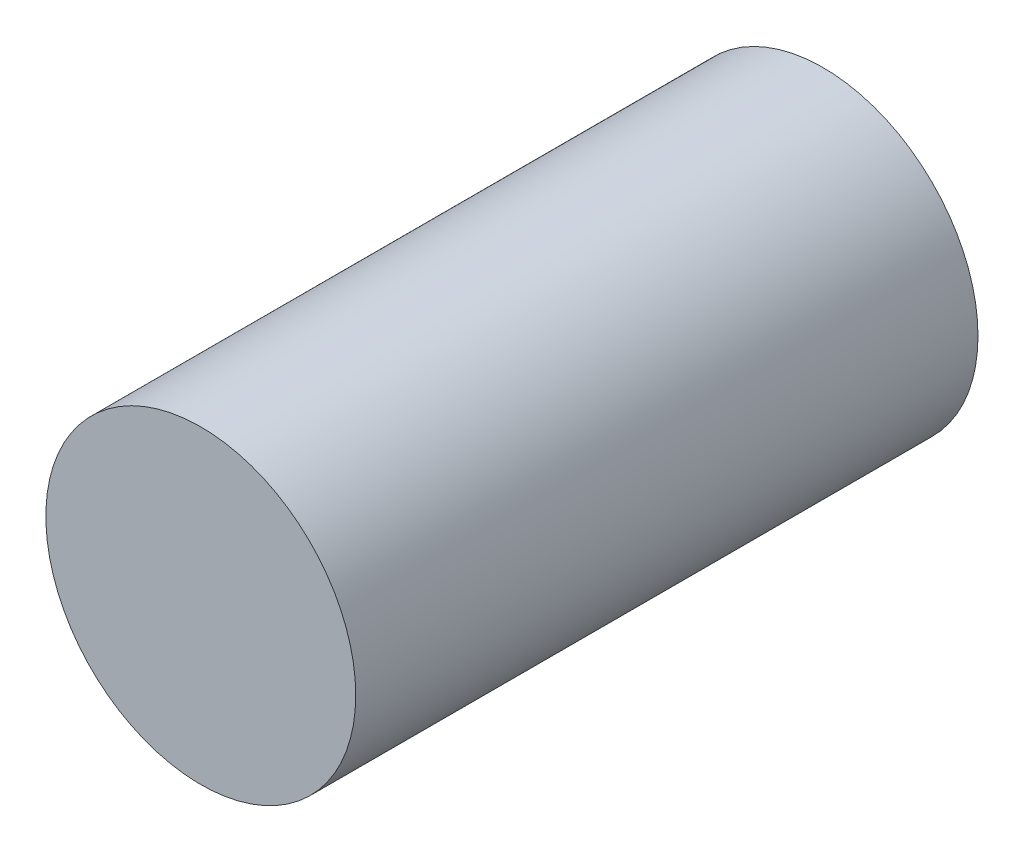
ISO-10303-21;
HEADER;
FILE_DESCRIPTION(('STEP AP214'),'2;1');
FILE_NAME('part.step','',(''),(''),'','','');
FILE_SCHEMA(('AUTOMOTIVE_DESIGN { 1 0 10303 214 1 1 1 1 }'));
ENDSEC;
DATA;
#1=APPLICATION_CONTEXT('core data for automotive mechanical design processes');
#2=APPLICATION_PROTOCOL_DEFINITION('international standard','automotive_design',2000,#1);
#3=PRODUCT_CONTEXT('',#1,'mechanical');
#4=PRODUCT('Part','Part','',(#3));
#5=PRODUCT_RELATED_PRODUCT_CATEGORY('part','',(#4));
#6=PRODUCT_DEFINITION_FORMATION('','',#4);
#7=PRODUCT_DEFINITION_CONTEXT('part definition',#1,'design');
#8=PRODUCT_DEFINITION('design','',#6,#7);
#9=PRODUCT_DEFINITION_SHAPE('','',#8);
#10=(LENGTH_UNIT() NAMED_UNIT(*) SI_UNIT(.MILLI.,.METRE.));
#11=(NAMED_UNIT(*) PLANE_ANGLE_UNIT() SI_UNIT($,.RADIAN.));
#12=(NAMED_UNIT(*) SI_UNIT($,.STERADIAN.) SOLID_ANGLE_UNIT());
#13=UNCERTAINTY_MEASURE_WITH_UNIT(LENGTH_MEASURE(1.E-05),#10,'distance_accuracy_value','');
#14=(GEOMETRIC_REPRESENTATION_CONTEXT(3) GLOBAL_UNCERTAINTY_ASSIGNED_CONTEXT((#13)) GLOBAL_UNIT_ASSIGNED_CONTEXT((#10,
#11,#12)) REPRESENTATION_CONTEXT('',''));
#15=CARTESIAN_POINT('',(0.,0.,0.));
#16=DIRECTION('',(0.,0.,1.));
#17=DIRECTION('',(1.,0.,0.));
#18=AXIS2_PLACEMENT_3D('',#15,#16,#17);
#19=CARTESIAN_POINT('',(0.,0.,10.));
#20=DIRECTION('',(0.,0.,-1.));
#21=DIRECTION('',(-1.,0.,0.));
#22=AXIS2_PLACEMENT_3D('',#19,#20,#21);
#23=CYLINDRICAL_SURFACE('',#22,2.49);
#24=CARTESIAN_POINT('',(0.,0.,10.));
#25=DIRECTION('',(0.,0.,1.));
#26=DIRECTION('',(1.,0.,0.));
#27=AXIS2_PLACEMENT_3D('',#24,#25,#26);
#28=CIRCLE('',#27,2.49);
#29=CARTESIAN_POINT('',(2.49,0.,10.));
#30=VERTEX_POINT('',#29);
#31=EDGE_CURVE('E10',#30,#30,#28,.T.);
#32=ORIENTED_EDGE('',*,*,#31,.F.);
#33=EDGE_LOOP('',(#32));
#34=FACE_BOUND('',#33,.T.);
#35=CARTESIAN_POINT('',(0.,0.,0.));
#36=DIRECTION('',(0.,0.,1.));
#37=DIRECTION('',(1.,0.,0.));
#38=AXIS2_PLACEMENT_3D('',#35,#36,#37);
#39=CIRCLE('',#38,2.49);
#40=CARTESIAN_POINT('',(2.49,0.,0.));
#41=VERTEX_POINT('',#40);
#42=EDGE_CURVE('E33',#41,#41,#39,.T.);
#43=ORIENTED_EDGE('',*,*,#42,.T.);
#44=EDGE_LOOP('',(#43));
#45=FACE_BOUND('',#44,.T.);
#46=ADVANCED_FACE('F30',(#34,#45),#23,.T.);
#47=CARTESIAN_POINT('',(0.,0.,10.));
#48=DIRECTION('',(0.,0.,1.));
#49=DIRECTION('',(1.,0.,0.));
#50=AXIS2_PLACEMENT_3D('',#47,#48,#49);
#51=PLANE('',#50);
#52=ORIENTED_EDGE('',*,*,#31,.T.);
#53=EDGE_LOOP('',(#52));
#54=FACE_BOUND('',#53,.T.);
#55=ADVANCED_FACE('F45',(#54),#51,.T.);
#56=CARTESIAN_POINT('',(0.,0.,0.));
#57=DIRECTION('',(0.,0.,1.));
#58=DIRECTION('',(1.,0.,0.));
#59=AXIS2_PLACEMENT_3D('',#56,#57,#58);
#60=PLANE('',#59);
#61=ORIENTED_EDGE('',*,*,#42,.F.);
#62=EDGE_LOOP('',(#61));
#63=FACE_BOUND('',#62,.T.);
#64=ADVANCED_FACE('F43',(#63),#60,.F.);
#65=CLOSED_SHELL('',(#46,#55,#64));
#66=MANIFOLD_SOLID_BREP('B2',#65);
#67=ADVANCED_BREP_SHAPE_REPRESENTATION('',(#18,#66),#14);
#68=SHAPE_DEFINITION_REPRESENTATION(#9,#67);
ENDSEC;
END-ISO-10303-21;
